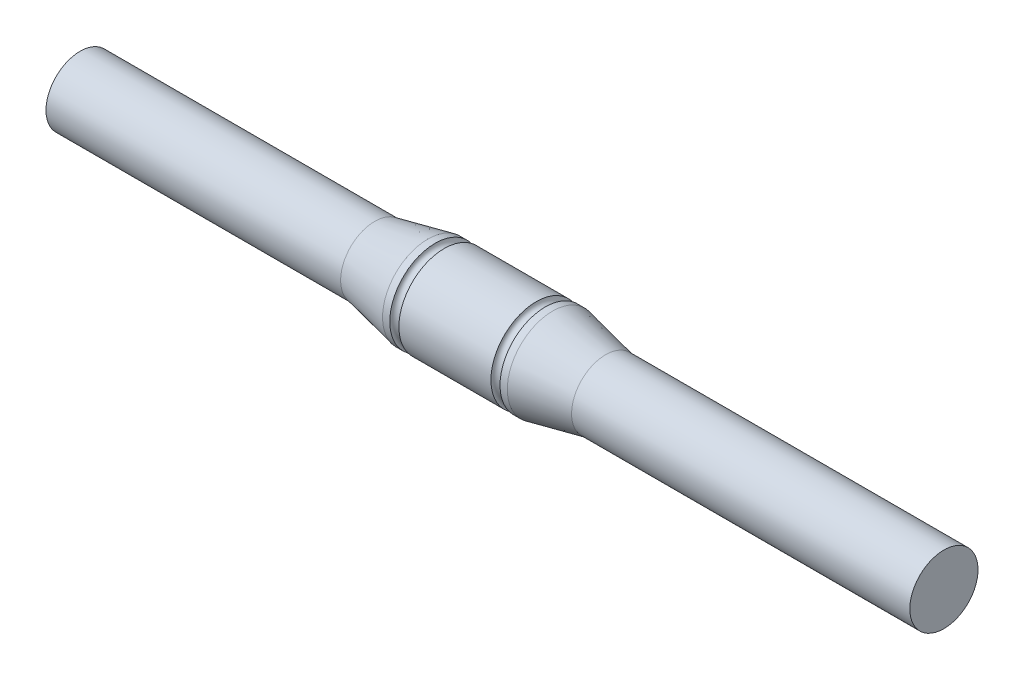
ISO-10303-21;
HEADER;
FILE_DESCRIPTION(('STEP AP214'),'2;1');
FILE_NAME('part.step','',(''),(''),'','','');
FILE_SCHEMA(('AUTOMOTIVE_DESIGN { 1 0 10303 214 1 1 1 1 }'));
ENDSEC;
DATA;
#1=APPLICATION_CONTEXT('core data for automotive mechanical design processes');
#2=APPLICATION_PROTOCOL_DEFINITION('international standard','automotive_design',2000,#1);
#3=PRODUCT_CONTEXT('',#1,'mechanical');
#4=PRODUCT('Part','Part','',(#3));
#5=PRODUCT_RELATED_PRODUCT_CATEGORY('part','',(#4));
#6=PRODUCT_DEFINITION_FORMATION('','',#4);
#7=PRODUCT_DEFINITION_CONTEXT('part definition',#1,'design');
#8=PRODUCT_DEFINITION('design','',#6,#7);
#9=PRODUCT_DEFINITION_SHAPE('','',#8);
#10=(LENGTH_UNIT() NAMED_UNIT(*) SI_UNIT(.MILLI.,.METRE.));
#11=(NAMED_UNIT(*) PLANE_ANGLE_UNIT() SI_UNIT($,.RADIAN.));
#12=(NAMED_UNIT(*) SI_UNIT($,.STERADIAN.) SOLID_ANGLE_UNIT());
#13=UNCERTAINTY_MEASURE_WITH_UNIT(LENGTH_MEASURE(1.E-05),#10,'distance_accuracy_value','');
#14=(GEOMETRIC_REPRESENTATION_CONTEXT(3) GLOBAL_UNCERTAINTY_ASSIGNED_CONTEXT((#13)) GLOBAL_UNIT_ASSIGNED_CONTEXT((#10,
#11,#12)) REPRESENTATION_CONTEXT('',''));
#15=CARTESIAN_POINT('',(0.,0.,0.));
#16=DIRECTION('',(0.,0.,1.));
#17=DIRECTION('',(1.,0.,0.));
#18=AXIS2_PLACEMENT_3D('',#15,#16,#17);
#19=CARTESIAN_POINT('',(0.,-4.81965,-4.81965));
#20=DIRECTION('',(-1.,0.,0.));
#21=DIRECTION('',(0.,0.,1.));
#22=AXIS2_PLACEMENT_3D('',#19,#20,#21);
#23=PLANE('',#22);
#24=CARTESIAN_POINT('',(0.,0.,0.));
#25=DIRECTION('',(-1.,0.,0.));
#26=DIRECTION('',(0.,0.,1.));
#27=AXIS2_PLACEMENT_3D('',#24,#25,#26);
#28=CIRCLE('',#27,4.7625);
#29=CARTESIAN_POINT('',(0.,0.,4.7625));
#30=VERTEX_POINT('',#29);
#31=EDGE_CURVE('E18',#30,#30,#28,.F.);
#32=ORIENTED_EDGE('',*,*,#31,.F.);
#33=EDGE_LOOP('',(#32));
#34=FACE_BOUND('',#33,.T.);
#35=ADVANCED_FACE('F14',(#34),#23,.T.);
#36=CARTESIAN_POINT('',(41.148,0.,0.));
#37=DIRECTION('',(-1.,0.,0.));
#38=DIRECTION('',(0.,0.,1.));
#39=AXIS2_PLACEMENT_3D('',#36,#37,#38);
#40=CYLINDRICAL_SURFACE('',#39,4.7625);
#41=ORIENTED_EDGE('',*,*,#31,.T.);
#42=EDGE_LOOP('',(#41));
#43=FACE_BOUND('',#42,.T.);
#44=CARTESIAN_POINT('',(41.148,0.,0.));
#45=DIRECTION('',(1.,0.,0.));
#46=DIRECTION('',(0.,0.,-1.));
#47=AXIS2_PLACEMENT_3D('',#44,#45,#46);
#48=CIRCLE('',#47,4.7625);
#49=CARTESIAN_POINT('',(41.148,0.,-4.7625));
#50=VERTEX_POINT('',#49);
#51=EDGE_CURVE('E46',#50,#50,#48,.T.);
#52=ORIENTED_EDGE('',*,*,#51,.F.);
#53=EDGE_LOOP('',(#52));
#54=FACE_BOUND('',#53,.T.);
#55=ADVANCED_FACE('F53',(#43,#54),#40,.T.);
#56=CARTESIAN_POINT('',(49.30648,0.,0.));
#57=DIRECTION('',(1.,0.,0.));
#58=DIRECTION('',(0.,0.,-1.));
#59=AXIS2_PLACEMENT_3D('',#56,#57,#58);
#60=CONICAL_SURFACE('',#59,6.48081,0.207582522603438);
#61=CARTESIAN_POINT('',(48.5648,0.,0.));
#62=DIRECTION('',(1.,0.,0.));
#63=DIRECTION('',(0.,1.,0.));
#64=AXIS2_PLACEMENT_3D('',#61,#62,#63);
#65=CIRCLE('',#64,6.3246);
#66=CARTESIAN_POINT('',(48.5648,6.3246,0.));
#67=VERTEX_POINT('',#66);
#68=EDGE_CURVE('E43',#67,#67,#65,.T.);
#69=ORIENTED_EDGE('',*,*,#68,.F.);
#70=EDGE_LOOP('',(#69));
#71=FACE_BOUND('',#70,.T.);
#72=ORIENTED_EDGE('',*,*,#51,.T.);
#73=EDGE_LOOP('',(#72));
#74=FACE_BOUND('',#73,.T.);
#75=ADVANCED_FACE('F62',(#71,#74),#60,.T.);
#76=CARTESIAN_POINT('',(49.6824,0.,0.));
#77=DIRECTION('',(-1.,0.,0.));
#78=DIRECTION('',(0.,-1.,0.));
#79=AXIS2_PLACEMENT_3D('',#76,#77,#78);
#80=CYLINDRICAL_SURFACE('',#79,6.3246);
#81=ORIENTED_EDGE('',*,*,#68,.T.);
#82=EDGE_LOOP('',(#81));
#83=FACE_BOUND('',#82,.T.);
#84=CARTESIAN_POINT('',(49.5808,0.,0.));
#85=DIRECTION('',(1.,0.,0.));
#86=DIRECTION('',(0.,1.,0.));
#87=AXIS2_PLACEMENT_3D('',#84,#85,#86);
#88=CIRCLE('',#87,6.32459999999985);
#89=CARTESIAN_POINT('',(49.5808,6.32459999999985,0.));
#90=VERTEX_POINT('',#89);
#91=EDGE_CURVE('E40',#90,#90,#88,.T.);
#92=ORIENTED_EDGE('',*,*,#91,.F.);
#93=EDGE_LOOP('',(#92));
#94=FACE_BOUND('',#93,.T.);
#95=ADVANCED_FACE('F94',(#83,#94),#80,.T.);
#96=CARTESIAN_POINT('',(50.2158000000002,0.,0.));
#97=DIRECTION('',(-1.,0.,0.));
#98=DIRECTION('',(0.,0.,1.));
#99=AXIS2_PLACEMENT_3D('',#96,#97,#98);
#100=TOROIDAL_SURFACE('',#99,6.32459999999982,0.634999999999822);
#101=ORIENTED_EDGE('',*,*,#91,.T.);
#102=EDGE_LOOP('',(#101));
#103=FACE_BOUND('',#102,.T.);
#104=CARTESIAN_POINT('',(50.8508,0.,0.));
#105=DIRECTION('',(1.,0.,0.));
#106=DIRECTION('',(0.,1.,0.));
#107=AXIS2_PLACEMENT_3D('',#104,#105,#106);
#108=CIRCLE('',#107,6.3246);
#109=CARTESIAN_POINT('',(50.8508,6.3246,0.));
#110=VERTEX_POINT('',#109);
#111=EDGE_CURVE('E37',#110,#110,#108,.T.);
#112=ORIENTED_EDGE('',*,*,#111,.F.);
#113=EDGE_LOOP('',(#112));
#114=FACE_BOUND('',#113,.T.);
#115=ADVANCED_FACE('F90',(#103,#114),#100,.F.);
#116=CARTESIAN_POINT('',(63.7032,0.,0.));
#117=DIRECTION('',(-1.,0.,0.));
#118=DIRECTION('',(0.,0.,1.));
#119=AXIS2_PLACEMENT_3D('',#116,#117,#118);
#120=CYLINDRICAL_SURFACE('',#119,6.3246);
#121=ORIENTED_EDGE('',*,*,#111,.T.);
#122=EDGE_LOOP('',(#121));
#123=FACE_BOUND('',#122,.T.);
#124=CARTESIAN_POINT('',(63.7032,0.,0.));
#125=DIRECTION('',(1.,0.,0.));
#126=DIRECTION('',(0.,1.,0.));
#127=AXIS2_PLACEMENT_3D('',#124,#125,#126);
#128=CIRCLE('',#127,6.32459999999985);
#129=CARTESIAN_POINT('',(63.7032,6.32459999999985,0.));
#130=VERTEX_POINT('',#129);
#131=EDGE_CURVE('E34',#130,#130,#128,.T.);
#132=ORIENTED_EDGE('',*,*,#131,.F.);
#133=EDGE_LOOP('',(#132));
#134=FACE_BOUND('',#133,.T.);
#135=ADVANCED_FACE('F86',(#123,#134),#120,.T.);
#136=CARTESIAN_POINT('',(64.3382000000002,0.,0.));
#137=DIRECTION('',(-1.,0.,0.));
#138=DIRECTION('',(0.,0.,1.));
#139=AXIS2_PLACEMENT_3D('',#136,#137,#138);
#140=TOROIDAL_SURFACE('',#139,6.32459999999984,0.634999999999843);
#141=ORIENTED_EDGE('',*,*,#131,.T.);
#142=EDGE_LOOP('',(#141));
#143=FACE_BOUND('',#142,.T.);
#144=CARTESIAN_POINT('',(64.9732,0.,0.));
#145=DIRECTION('',(1.,0.,0.));
#146=DIRECTION('',(0.,1.,0.));
#147=AXIS2_PLACEMENT_3D('',#144,#145,#146);
#148=CIRCLE('',#147,6.3246);
#149=CARTESIAN_POINT('',(64.9732,6.3246,0.));
#150=VERTEX_POINT('',#149);
#151=EDGE_CURVE('E31',#150,#150,#148,.T.);
#152=ORIENTED_EDGE('',*,*,#151,.F.);
#153=EDGE_LOOP('',(#152));
#154=FACE_BOUND('',#153,.T.);
#155=ADVANCED_FACE('F80',(#143,#154),#140,.F.);
#156=CARTESIAN_POINT('',(66.0908,0.,0.));
#157=DIRECTION('',(-1.,0.,0.));
#158=DIRECTION('',(0.,0.,1.));
#159=AXIS2_PLACEMENT_3D('',#156,#157,#158);
#160=CYLINDRICAL_SURFACE('',#159,6.3246);
#161=ORIENTED_EDGE('',*,*,#151,.T.);
#162=EDGE_LOOP('',(#161));
#163=FACE_BOUND('',#162,.T.);
#164=CARTESIAN_POINT('',(65.9892,0.,0.));
#165=DIRECTION('',(1.,0.,0.));
#166=DIRECTION('',(0.,0.,-1.));
#167=AXIS2_PLACEMENT_3D('',#164,#165,#166);
#168=CIRCLE('',#167,6.3246);
#169=CARTESIAN_POINT('',(65.9892,0.,-6.3246));
#170=VERTEX_POINT('',#169);
#171=EDGE_CURVE('E27',#170,#170,#168,.T.);
#172=ORIENTED_EDGE('',*,*,#171,.F.);
#173=EDGE_LOOP('',(#172));
#174=FACE_BOUND('',#173,.T.);
#175=ADVANCED_FACE('F75',(#163,#174),#160,.T.);
#176=CARTESIAN_POINT('',(120.65,-4.81965,4.81965));
#177=DIRECTION('',(1.,0.,0.));
#178=DIRECTION('',(0.,0.,-1.));
#179=AXIS2_PLACEMENT_3D('',#176,#177,#178);
#180=PLANE('',#179);
#181=CARTESIAN_POINT('',(120.65,0.,0.));
#182=DIRECTION('',(-1.,0.,0.));
#183=DIRECTION('',(0.,-1.,0.));
#184=AXIS2_PLACEMENT_3D('',#181,#182,#183);
#185=CIRCLE('',#184,4.7625);
#186=CARTESIAN_POINT('',(120.65,-4.7625,0.));
#187=VERTEX_POINT('',#186);
#188=EDGE_CURVE('E22',#187,#187,#185,.T.);
#189=ORIENTED_EDGE('',*,*,#188,.F.);
#190=EDGE_LOOP('',(#189));
#191=FACE_BOUND('',#190,.T.);
#192=ADVANCED_FACE('F69',(#191),#180,.T.);
#193=CARTESIAN_POINT('',(65.24752,0.,0.));
#194=DIRECTION('',(-1.,0.,0.));
#195=DIRECTION('',(0.,0.,1.));
#196=AXIS2_PLACEMENT_3D('',#193,#194,#195);
#197=CONICAL_SURFACE('',#196,6.48081,0.207582522603439);
#198=ORIENTED_EDGE('',*,*,#171,.T.);
#199=EDGE_LOOP('',(#198));
#200=FACE_BOUND('',#199,.T.);
#201=CARTESIAN_POINT('',(73.406,0.,0.));
#202=DIRECTION('',(1.,0.,0.));
#203=DIRECTION('',(0.,0.,-1.));
#204=AXIS2_PLACEMENT_3D('',#201,#202,#203);
#205=CIRCLE('',#204,4.7625);
#206=CARTESIAN_POINT('',(73.406,0.,-4.7625));
#207=VERTEX_POINT('',#206);
#208=EDGE_CURVE('E10',#207,#207,#205,.T.);
#209=ORIENTED_EDGE('',*,*,#208,.F.);
#210=EDGE_LOOP('',(#209));
#211=FACE_BOUND('',#210,.T.);
#212=ADVANCED_FACE('F65',(#200,#211),#197,.T.);
#213=CARTESIAN_POINT('',(120.65,0.,0.));
#214=DIRECTION('',(-1.,0.,0.));
#215=DIRECTION('',(0.,-1.,0.));
#216=AXIS2_PLACEMENT_3D('',#213,#214,#215);
#217=CYLINDRICAL_SURFACE('',#216,4.7625);
#218=ORIENTED_EDGE('',*,*,#208,.T.);
#219=EDGE_LOOP('',(#218));
#220=FACE_BOUND('',#219,.T.);
#221=ORIENTED_EDGE('',*,*,#188,.T.);
#222=EDGE_LOOP('',(#221));
#223=FACE_BOUND('',#222,.T.);
#224=ADVANCED_FACE('F16',(#220,#223),#217,.T.);
#225=CLOSED_SHELL('',(#35,#55,#75,#95,#115,#135,#155,#175,#192,#212,#224));
#226=MANIFOLD_SOLID_BREP('B1',#225);
#227=ADVANCED_BREP_SHAPE_REPRESENTATION('',(#18,#226),#14);
#228=SHAPE_DEFINITION_REPRESENTATION(#9,#227);
ENDSEC;
END-ISO-10303-21;
